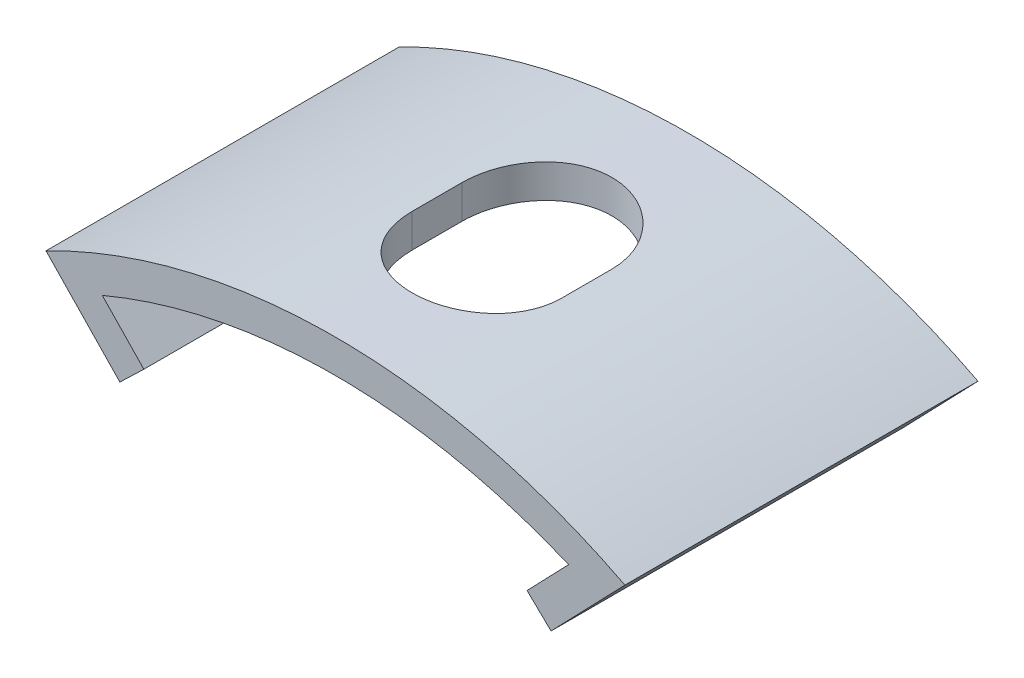
ISO-10303-21;
HEADER;
FILE_DESCRIPTION(('STEP AP214'),'2;1');
FILE_NAME('part.step','',(''),(''),'','','');
FILE_SCHEMA(('AUTOMOTIVE_DESIGN { 1 0 10303 214 1 1 1 1 }'));
ENDSEC;
DATA;
#1=APPLICATION_CONTEXT('core data for automotive mechanical design processes');
#2=APPLICATION_PROTOCOL_DEFINITION('international standard','automotive_design',2000,#1);
#3=PRODUCT_CONTEXT('',#1,'mechanical');
#4=PRODUCT('Part','Part','',(#3));
#5=PRODUCT_RELATED_PRODUCT_CATEGORY('part','',(#4));
#6=PRODUCT_DEFINITION_FORMATION('','',#4);
#7=PRODUCT_DEFINITION_CONTEXT('part definition',#1,'design');
#8=PRODUCT_DEFINITION('design','',#6,#7);
#9=PRODUCT_DEFINITION_SHAPE('','',#8);
#10=(LENGTH_UNIT() NAMED_UNIT(*) SI_UNIT(.MILLI.,.METRE.));
#11=(NAMED_UNIT(*) PLANE_ANGLE_UNIT() SI_UNIT($,.RADIAN.));
#12=(NAMED_UNIT(*) SI_UNIT($,.STERADIAN.) SOLID_ANGLE_UNIT());
#13=UNCERTAINTY_MEASURE_WITH_UNIT(LENGTH_MEASURE(1.E-05),#10,'distance_accuracy_value','');
#14=(GEOMETRIC_REPRESENTATION_CONTEXT(3) GLOBAL_UNCERTAINTY_ASSIGNED_CONTEXT((#13)) GLOBAL_UNIT_ASSIGNED_CONTEXT((#10,
#11,#12)) REPRESENTATION_CONTEXT('',''));
#15=CARTESIAN_POINT('',(0.,0.,0.));
#16=DIRECTION('',(0.,0.,1.));
#17=DIRECTION('',(1.,0.,0.));
#18=AXIS2_PLACEMENT_3D('',#15,#16,#17);
#19=CARTESIAN_POINT('',(0.,0.,5.3));
#20=DIRECTION('',(0.,0.,-1.));
#21=DIRECTION('',(-1.,0.,0.));
#22=AXIS2_PLACEMENT_3D('',#19,#20,#21);
#23=CYLINDRICAL_SURFACE('',#22,18.);
#24=CARTESIAN_POINT('',(0.,0.,-5.3));
#25=DIRECTION('',(0.,0.,1.));
#26=DIRECTION('',(1.,0.,0.));
#27=AXIS2_PLACEMENT_3D('',#24,#25,#26);
#28=CIRCLE('',#27,18.);
#29=CARTESIAN_POINT('',(7.,16.583123951777,-5.3));
#30=VERTEX_POINT('',#29);
#31=CARTESIAN_POINT('',(-7.,16.583123951777,-5.3));
#32=VERTEX_POINT('',#31);
#33=EDGE_CURVE('E225',#30,#32,#28,.T.);
#34=ORIENTED_EDGE('',*,*,#33,.F.);
#35=DIRECTION('',(0.,0.,-1.));
#36=VECTOR('',#35,1.);
#37=CARTESIAN_POINT('',(7.,16.583123951777,5.3));
#38=LINE('',#37,#36);
#39=CARTESIAN_POINT('',(7.,16.583123951777,5.3));
#40=VERTEX_POINT('',#39);
#41=EDGE_CURVE('E246',#40,#30,#38,.T.);
#42=ORIENTED_EDGE('',*,*,#41,.F.);
#43=CARTESIAN_POINT('',(0.,0.,5.3));
#44=DIRECTION('',(0.,0.,1.));
#45=DIRECTION('',(1.,0.,0.));
#46=AXIS2_PLACEMENT_3D('',#43,#44,#45);
#47=CIRCLE('',#46,18.);
#48=CARTESIAN_POINT('',(-7.,16.583123951777,5.3));
#49=VERTEX_POINT('',#48);
#50=EDGE_CURVE('E260',#40,#49,#47,.T.);
#51=ORIENTED_EDGE('',*,*,#50,.T.);
#52=DIRECTION('',(0.,0.,-1.));
#53=VECTOR('',#52,1.);
#54=CARTESIAN_POINT('',(-7.,16.583123951777,5.3));
#55=LINE('',#54,#53);
#56=EDGE_CURVE('E248',#49,#32,#55,.T.);
#57=ORIENTED_EDGE('',*,*,#56,.T.);
#58=EDGE_LOOP('',(#34,#42,#51,#57));
#59=FACE_BOUND('',#58,.T.);
#60=DIRECTION('',(0.,0.,-1.));
#61=VECTOR('',#60,1.);
#62=CARTESIAN_POINT('',(-2.25,17.858821349686,5.3));
#63=LINE('',#62,#61);
#64=CARTESIAN_POINT('',(-2.25,17.858821349686,-0.75));
#65=VERTEX_POINT('',#64);
#66=CARTESIAN_POINT('',(-2.25,17.858821349686,0.75));
#67=VERTEX_POINT('',#66);
#68=EDGE_CURVE('E173',#65,#67,#63,.F.);
#69=ORIENTED_EDGE('',*,*,#68,.T.);
#70=CARTESIAN_POINT('',(-2.25,17.858821349686,0.75));
#71=CARTESIAN_POINT('',(-2.24999987433453,17.8588194251762,0.813038421910983));
#72=CARTESIAN_POINT('',(-2.24734910280741,17.8591555464734,0.876046400447922));
#73=CARTESIAN_POINT('',(-2.2367760280738,17.860483614898,1.00160662816571));
#74=CARTESIAN_POINT('',(-2.22885413082701,17.8614755115204,1.06415891206719));
#75=CARTESIAN_POINT('',(-2.19726613729562,17.8653995354746,1.25031674039511));
#76=CARTESIAN_POINT('',(-2.16577747401027,17.8692801491553,1.37266760263013));
#77=CARTESIAN_POINT('',(-2.08284998220627,17.8791347069465,1.61029050708662));
#78=CARTESIAN_POINT('',(-2.03140462668968,17.8851093358599,1.72556021905842));
#79=CARTESIAN_POINT('',(-1.9100445468626,17.8984759849888,1.94583988541639));
#80=CARTESIAN_POINT('',(-1.8401312637343,17.9058678945916,2.0508506395056));
#81=CARTESIAN_POINT('',(-1.68341206734406,17.9212816202412,2.24819255503716));
#82=CARTESIAN_POINT('',(-1.59652505875848,17.9293063453518,2.34045906512173));
#83=CARTESIAN_POINT('',(-1.4084881592424,17.9450563047993,2.50915218989586));
#84=CARTESIAN_POINT('',(-1.30733609827826,17.9527814933416,2.58557639023872));
#85=CARTESIAN_POINT('',(-1.09323565451996,17.9670912133723,2.72063635035758));
#86=CARTESIAN_POINT('',(-0.980249611183446,17.9736719143119,2.77921284845707));
#87=CARTESIAN_POINT('',(-0.745954846626403,17.9849184109182,2.87653235189302));
#88=CARTESIAN_POINT('',(-0.624646927843693,17.98958439091,2.9152772664524));
#89=CARTESIAN_POINT('',(-0.377817617303712,17.9964554763961,2.97164252706326));
#90=CARTESIAN_POINT('',(-0.252321524361256,17.9986733000917,2.98937208399253));
#91=CARTESIAN_POINT('',(-0.000113958053788392,18.0004416380206,3.00354192890028));
#92=CARTESIAN_POINT('',(0.126597496892533,17.9999921926125,2.9999825390033));
#93=CARTESIAN_POINT('',(0.376889084753837,17.996486825208,2.97176228226685));
#94=CARTESIAN_POINT('',(0.500482760825345,17.9934454852649,2.94721946613686));
#95=CARTESIAN_POINT('',(0.741782589261214,17.9851144748259,2.87791368788275));
#96=CARTESIAN_POINT('',(0.859488661703709,17.9798247738188,2.83315045135721));
#97=CARTESIAN_POINT('',(1.08604033017171,17.9675661901284,2.72454804183679));
#98=CARTESIAN_POINT('',(1.19486100591024,17.9605927880744,2.66065741466114));
#99=CARTESIAN_POINT('',(1.40027581309508,17.9457473888532,2.51565390113486));
#100=CARTESIAN_POINT('',(1.49686990014344,17.9378753884233,2.43454095224834));
#101=CARTESIAN_POINT('',(1.67577600776006,17.9220509715218,2.25674697940169));
#102=CARTESIAN_POINT('',(1.75798787566357,17.9140983698413,2.15996517270914));
#103=CARTESIAN_POINT('',(1.90504051240019,17.8990587520914,1.95388697055325));
#104=CARTESIAN_POINT('',(1.96987611791605,17.8919719936451,1.84458686904738));
#105=CARTESIAN_POINT('',(2.08034030367041,17.8794655923308,1.61647074802186));
#106=CARTESIAN_POINT('',(2.12594942241975,17.8740476401532,1.49764523072224));
#107=CARTESIAN_POINT('',(2.19647134414845,17.8655197697751,1.25402518960859));
#108=CARTESIAN_POINT('',(2.22141531410094,17.8624063766198,1.12923995593975));
#109=CARTESIAN_POINT('',(2.24045955676342,17.860021010604,0.961297341119165));
#110=CARTESIAN_POINT('',(2.24403891993201,17.8595714574598,0.919080958189035));
#111=CARTESIAN_POINT('',(2.24880594188023,17.8589719767877,0.834582343684646));
#112=CARTESIAN_POINT('',(2.2499976086946,17.8588215471485,0.792300341894064));
#113=CARTESIAN_POINT('',(2.25,17.858821349686,0.75));
#114=B_SPLINE_CURVE_WITH_KNOTS('',3,(#70,#71,#72,#73,#74,#75,#76,#77,#78,#79,#80,#81,#82,#83,
#84,#85,#86,#87,#88,#89,#90,#91,#92,#93,#94,#95,#96,#97,#98,#99,#100,#101,#102,#103,#104,#105,
#106,#107,#108,#109,#110,#111,#112,#113),.UNSPECIFIED.,.F.,.F.,(4,2,2,2,2,2,2,2,2,2,2,2,2,2,2,2,
2,2,2,2,2,4),(0.,0.188998328147948,0.377982102132345,0.755226013918386,1.13259341054784,
1.50993136724195,1.88911828117894,2.2683629402761,2.6488534582724,3.02930733885574,
3.40777531688837,3.78623756831039,4.16258453387273,4.53893660680898,4.91631033520017,
5.29368543389454,5.6735920154572,6.05361136055525,6.43401445159375,6.81384277259916,
6.94090357256708,7.06775090645285),.UNSPECIFIED.);
#115=CARTESIAN_POINT('',(2.25,17.858821349686,0.75));
#116=VERTEX_POINT('',#115);
#117=EDGE_CURVE('E138',#67,#116,#114,.T.);
#118=ORIENTED_EDGE('',*,*,#117,.T.);
#119=DIRECTION('',(0.,0.,-1.));
#120=VECTOR('',#119,1.);
#121=CARTESIAN_POINT('',(2.25,17.858821349686,5.3));
#122=LINE('',#121,#120);
#123=CARTESIAN_POINT('',(2.25,17.858821349686,-0.75));
#124=VERTEX_POINT('',#123);
#125=EDGE_CURVE('E172',#116,#124,#122,.T.);
#126=ORIENTED_EDGE('',*,*,#125,.T.);
#127=CARTESIAN_POINT('',(2.25,17.858821349686,-0.75));
#128=CARTESIAN_POINT('',(2.24999987433453,17.8588194251762,-0.813038421910983));
#129=CARTESIAN_POINT('',(2.24734910280741,17.8591555464734,-0.876046400447922));
#130=CARTESIAN_POINT('',(2.2367760280738,17.860483614898,-1.00160662816571));
#131=CARTESIAN_POINT('',(2.22885413082701,17.8614755115204,-1.06415891206719));
#132=CARTESIAN_POINT('',(2.19726613729562,17.8653995354746,-1.25031674039511));
#133=CARTESIAN_POINT('',(2.16577747401027,17.8692801491553,-1.37266760263013));
#134=CARTESIAN_POINT('',(2.08284998220627,17.8791347069465,-1.61029050708662));
#135=CARTESIAN_POINT('',(2.03140462668968,17.8851093358599,-1.72556021905842));
#136=CARTESIAN_POINT('',(1.91004454686259,17.8984759849888,-1.94583988541639));
#137=CARTESIAN_POINT('',(1.8401312637343,17.9058678945916,-2.0508506395056));
#138=CARTESIAN_POINT('',(1.68341206734406,17.9212816202412,-2.24819255503716));
#139=CARTESIAN_POINT('',(1.59652505875848,17.9293063453518,-2.34045906512173));
#140=CARTESIAN_POINT('',(1.4084881592424,17.9450563047993,-2.50915218989586));
#141=CARTESIAN_POINT('',(1.30733609827826,17.9527814933416,-2.58557639023872));
#142=CARTESIAN_POINT('',(1.09323565451996,17.9670912133723,-2.72063635035758));
#143=CARTESIAN_POINT('',(0.980249611183446,17.9736719143119,-2.77921284845707));
#144=CARTESIAN_POINT('',(0.745954846626401,17.9849184109182,-2.87653235189302));
#145=CARTESIAN_POINT('',(0.624646927843692,17.98958439091,-2.9152772664524));
#146=CARTESIAN_POINT('',(0.377817617303711,17.9964554763961,-2.97164252706327));
#147=CARTESIAN_POINT('',(0.252321524361255,17.9986733000917,-2.98937208399253));
#148=CARTESIAN_POINT('',(0.000113958053786956,18.0004416380206,-3.00354192890028));
#149=CARTESIAN_POINT('',(-0.126597496892535,17.9999921926125,-2.9999825390033));
#150=CARTESIAN_POINT('',(-0.376889084753838,17.996486825208,-2.97176228226685));
#151=CARTESIAN_POINT('',(-0.500482760825348,17.9934454852649,-2.94721946613686));
#152=CARTESIAN_POINT('',(-0.741782589261217,17.9851144748259,-2.87791368788275));
#153=CARTESIAN_POINT('',(-0.859488661703711,17.9798247738188,-2.83315045135721));
#154=CARTESIAN_POINT('',(-1.08604033017171,17.9675661901284,-2.72454804183679));
#155=CARTESIAN_POINT('',(-1.19486100591024,17.9605927880744,-2.66065741466114));
#156=CARTESIAN_POINT('',(-1.40027581309508,17.9457473888532,-2.51565390113486));
#157=CARTESIAN_POINT('',(-1.49686990014345,17.9378753884233,-2.43454095224834));
#158=CARTESIAN_POINT('',(-1.67577600776006,17.9220509715218,-2.25674697940169));
#159=CARTESIAN_POINT('',(-1.75798787566357,17.9140983698413,-2.15996517270914));
#160=CARTESIAN_POINT('',(-1.90504051240019,17.8990587520914,-1.95388697055325));
#161=CARTESIAN_POINT('',(-1.96987611791605,17.8919719936451,-1.84458686904739));
#162=CARTESIAN_POINT('',(-2.08034030367041,17.8794655923308,-1.61647074802187));
#163=CARTESIAN_POINT('',(-2.12594942241975,17.8740476401532,-1.49764523072224));
#164=CARTESIAN_POINT('',(-2.19647134414845,17.8655197697751,-1.25402518960859));
#165=CARTESIAN_POINT('',(-2.22141531410094,17.8624063766198,-1.12923995593975));
#166=CARTESIAN_POINT('',(-2.24045955676343,17.860021010604,-0.961297341119165));
#167=CARTESIAN_POINT('',(-2.24403891993201,17.8595714574598,-0.919080958189035));
#168=CARTESIAN_POINT('',(-2.24880594188023,17.8589719767877,-0.834582343684645));
#169=CARTESIAN_POINT('',(-2.24999760869461,17.8588215471485,-0.792300341894064));
#170=CARTESIAN_POINT('',(-2.25,17.858821349686,-0.749999999999999));
#171=B_SPLINE_CURVE_WITH_KNOTS('',3,(#127,#128,#129,#130,#131,#132,#133,#134,#135,#136,#137,
#138,#139,#140,#141,#142,#143,#144,#145,#146,#147,#148,#149,#150,#151,#152,#153,#154,#155,#156,
#157,#158,#159,#160,#161,#162,#163,#164,#165,#166,#167,#168,#169,#170),.UNSPECIFIED.,.F.,.F.,(4,
2,2,2,2,2,2,2,2,2,2,2,2,2,2,2,2,2,2,2,2,4),(0.,0.188998328147948,0.377982102132345,
0.755226013918386,1.13259341054784,1.50993136724195,1.88911828117894,2.2683629402761,
2.6488534582724,3.02930733885574,3.40777531688837,3.78623756831039,4.16258453387273,
4.53893660680899,4.91631033520017,5.29368543389454,5.6735920154572,6.05361136055525,
6.43401445159375,6.81384277259917,6.94090357256708,7.06775090645286),.UNSPECIFIED.);
#172=EDGE_CURVE('E164',#124,#65,#171,.T.);
#173=ORIENTED_EDGE('',*,*,#172,.T.);
#174=EDGE_LOOP('',(#69,#118,#126,#173));
#175=FACE_BOUND('',#174,.T.);
#176=ADVANCED_FACE('F35',(#59,#175),#23,.F.);
#177=CARTESIAN_POINT('',(0.,0.,5.3));
#178=DIRECTION('',(0.,0.,-1.));
#179=DIRECTION('',(-1.,0.,0.));
#180=AXIS2_PLACEMENT_3D('',#177,#178,#179);
#181=CYLINDRICAL_SURFACE('',#180,19.);
#182=CARTESIAN_POINT('',(0.,0.,-5.3));
#183=DIRECTION('',(0.,0.,1.));
#184=DIRECTION('',(1.,0.,0.));
#185=AXIS2_PLACEMENT_3D('',#182,#183,#184);
#186=CIRCLE('',#185,19.);
#187=CARTESIAN_POINT('',(8.68969024076547,16.896428129032,-5.3));
#188=VERTEX_POINT('',#187);
#189=CARTESIAN_POINT('',(-8.68969024076547,16.896428129032,-5.3));
#190=VERTEX_POINT('',#189);
#191=EDGE_CURVE('E210',#188,#190,#186,.T.);
#192=ORIENTED_EDGE('',*,*,#191,.T.);
#193=DIRECTION('',(0.,0.,-1.));
#194=VECTOR('',#193,1.);
#195=CARTESIAN_POINT('',(-8.68969024076547,16.896428129032,5.3));
#196=LINE('',#195,#194);
#197=CARTESIAN_POINT('',(-8.68969024076547,16.896428129032,5.3));
#198=VERTEX_POINT('',#197);
#199=EDGE_CURVE('E237',#198,#190,#196,.T.);
#200=ORIENTED_EDGE('',*,*,#199,.F.);
#201=CARTESIAN_POINT('',(0.,0.,5.3));
#202=DIRECTION('',(0.,0.,1.));
#203=DIRECTION('',(1.,0.,0.));
#204=AXIS2_PLACEMENT_3D('',#201,#202,#203);
#205=CIRCLE('',#204,19.);
#206=CARTESIAN_POINT('',(8.68969024076547,16.896428129032,5.3));
#207=VERTEX_POINT('',#206);
#208=EDGE_CURVE('E221',#207,#198,#205,.T.);
#209=ORIENTED_EDGE('',*,*,#208,.F.);
#210=DIRECTION('',(0.,0.,-1.));
#211=VECTOR('',#210,1.);
#212=CARTESIAN_POINT('',(8.68969024076547,16.896428129032,5.3));
#213=LINE('',#212,#211);
#214=EDGE_CURVE('E239',#207,#188,#213,.T.);
#215=ORIENTED_EDGE('',*,*,#214,.T.);
#216=EDGE_LOOP('',(#192,#200,#209,#215));
#217=FACE_BOUND('',#216,.T.);
#218=CARTESIAN_POINT('',(-2.25,18.8663059447259,0.75));
#219=CARTESIAN_POINT('',(-2.24999984413377,18.866304126766,0.813065444008957));
#220=CARTESIAN_POINT('',(-2.24734683038286,18.8666225662772,0.876100456864434));
#221=CARTESIAN_POINT('',(-2.23676461239271,18.8678808036718,1.00171506453087));
#222=CARTESIAN_POINT('',(-2.22883579857183,18.8688205555769,1.06429469269468));
#223=CARTESIAN_POINT('',(-2.19721906511498,18.8725384514377,1.25053881791379));
#224=CARTESIAN_POINT('',(-2.16570059497972,18.876215376971,1.37294884829296));
#225=CARTESIAN_POINT('',(-2.08268940200505,18.8855534165936,1.61068939978139));
#226=CARTESIAN_POINT('',(-2.0311898629049,18.8912152077282,1.72601748941873));
#227=CARTESIAN_POINT('',(-1.9096974928355,18.9038824486064,1.94640209506089));
#228=CARTESIAN_POINT('',(-1.83970632808281,18.9108877772729,2.05145953535055));
#229=CARTESIAN_POINT('',(-1.68285058840054,18.9254914459535,2.2488249331985));
#230=CARTESIAN_POINT('',(-1.59591314397453,18.9330922589904,2.34107477466332));
#231=CARTESIAN_POINT('',(-1.40777799267168,18.9480090918228,2.50972207917964));
#232=CARTESIAN_POINT('',(-1.3065781169975,18.9553250680887,2.5861171269167));
#233=CARTESIAN_POINT('',(-1.09242950974802,18.9688725160587,2.72108165180554));
#234=CARTESIAN_POINT('',(-0.979447124621018,18.975100737433,2.77959808332987));
#235=CARTESIAN_POINT('',(-0.745179993513777,18.985743053388,2.87680195802174));
#236=CARTESIAN_POINT('',(-0.623896020192753,18.9901573165335,2.91549124373732));
#237=CARTESIAN_POINT('',(-0.377065646956689,18.9966571872975,2.97177169513252));
#238=CARTESIAN_POINT('',(-0.251541895868488,18.9987536150932,2.98946092262533));
#239=CARTESIAN_POINT('',(0.000711970235301823,19.0004185383706,3.00354301109507));
#240=CARTESIAN_POINT('',(0.127442071650238,18.9999870623187,2.99993611188586));
#241=CARTESIAN_POINT('',(0.377837656700778,18.9966534829824,2.9716064392706));
#242=CARTESIAN_POINT('',(0.501515328123363,18.9937637890536,2.94698972369523));
#243=CARTESIAN_POINT('',(0.742970891810421,18.9858525077212,2.87750493446024));
#244=CARTESIAN_POINT('',(0.860748713087663,18.9808308946732,2.83263661719752));
#245=CARTESIAN_POINT('',(1.08739417162659,18.9691986105771,2.72380756445231));
#246=CARTESIAN_POINT('',(1.19623924436736,18.9625840719268,2.65980026694911));
#247=CARTESIAN_POINT('',(1.4016780442815,18.9485069935124,2.51454671739229));
#248=CARTESIAN_POINT('',(1.49827179267252,18.9410444552171,2.43330049519482));
#249=CARTESIAN_POINT('',(1.67708146493049,18.9260538253829,2.25529359456109));
#250=CARTESIAN_POINT('',(1.75920752476244,18.9185256093612,2.15844264223406));
#251=CARTESIAN_POINT('',(1.90607611238423,18.9042941674795,1.95224612854428));
#252=CARTESIAN_POINT('',(1.97081344036131,18.8975911887167,1.84289684366567));
#253=CARTESIAN_POINT('',(2.08106902250753,18.8857682243098,1.61471612700434));
#254=CARTESIAN_POINT('',(2.12656907316942,18.8806497392327,1.49587584007561));
#255=CARTESIAN_POINT('',(2.19687527764837,18.872599510043,1.25225438931704));
#256=CARTESIAN_POINT('',(2.22171263247485,18.8696644696046,1.12748248463915));
#257=CARTESIAN_POINT('',(2.2405901012447,18.8674260294376,0.959849720419371));
#258=CARTESIAN_POINT('',(2.24412051000476,18.8670062867246,0.917921350010672));
#259=CARTESIAN_POINT('',(2.24882229454311,18.8664465763562,0.834001213167836));
#260=CARTESIAN_POINT('',(2.24999761940603,18.8663061403527,0.792009671218649));
#261=CARTESIAN_POINT('',(2.25,18.8663059447259,0.75));
#262=B_SPLINE_CURVE_WITH_KNOTS('',3,(#218,#219,#220,#221,#222,#223,#224,#225,#226,#227,#228,
#229,#230,#231,#232,#233,#234,#235,#236,#237,#238,#239,#240,#241,#242,#243,#244,#245,#246,#247,
#248,#249,#250,#251,#252,#253,#254,#255,#256,#257,#258,#259,#260,#261),.UNSPECIFIED.,.F.,.F.,(4,
2,2,2,2,2,2,2,2,2,2,2,2,2,2,2,2,2,2,2,2,4),(0.,0.189079425503063,0.378144860356892,
0.755564078222733,1.13311216071341,1.510626235245,1.88980094259794,2.26903337097799,
2.64938028868305,3.02969185411809,3.40822044347497,3.7867447702622,4.16336952684837,
4.53999881391062,4.91755193870435,5.29510440961777,5.67492510427658,6.05485925190686,
6.4351521165356,6.81486968499599,6.94105757499129,7.06703369118151),.UNSPECIFIED.);
#263=CARTESIAN_POINT('',(-2.25,18.8663059447259,0.75));
#264=VERTEX_POINT('',#263);
#265=CARTESIAN_POINT('',(2.25,18.8663059447259,0.75));
#266=VERTEX_POINT('',#265);
#267=EDGE_CURVE('E11',#264,#266,#262,.T.);
#268=ORIENTED_EDGE('',*,*,#267,.F.);
#269=DIRECTION('',(0.,0.,-1.));
#270=VECTOR('',#269,1.);
#271=CARTESIAN_POINT('',(-2.25,18.8663059447259,5.3));
#272=LINE('',#271,#270);
#273=CARTESIAN_POINT('',(-2.25,18.8663059447259,-0.750000000000001));
#274=VERTEX_POINT('',#273);
#275=EDGE_CURVE('E125',#274,#264,#272,.F.);
#276=ORIENTED_EDGE('',*,*,#275,.F.);
#277=CARTESIAN_POINT('',(2.25,18.8663059447259,-0.75));
#278=CARTESIAN_POINT('',(2.24999984413377,18.866304126766,-0.813065444008957));
#279=CARTESIAN_POINT('',(2.24734683038285,18.8666225662772,-0.876100456864433));
#280=CARTESIAN_POINT('',(2.23676461239271,18.8678808036718,-1.00171506453087));
#281=CARTESIAN_POINT('',(2.22883579857183,18.8688205555769,-1.06429469269468));
#282=CARTESIAN_POINT('',(2.19721906511497,18.8725384514377,-1.25053881791379));
#283=CARTESIAN_POINT('',(2.16570059497971,18.876215376971,-1.37294884829296));
#284=CARTESIAN_POINT('',(2.08268940200505,18.8855534165936,-1.61068939978139));
#285=CARTESIAN_POINT('',(2.0311898629049,18.8912152077282,-1.72601748941873));
#286=CARTESIAN_POINT('',(1.9096974928355,18.9038824486064,-1.94640209506089));
#287=CARTESIAN_POINT('',(1.8397063280828,18.9108877772729,-2.05145953535055));
#288=CARTESIAN_POINT('',(1.68285058840054,18.9254914459535,-2.2488249331985));
#289=CARTESIAN_POINT('',(1.59591314397453,18.9330922589904,-2.34107477466332));
#290=CARTESIAN_POINT('',(1.40777799267168,18.9480090918228,-2.50972207917964));
#291=CARTESIAN_POINT('',(1.30657811699749,18.9553250680887,-2.5861171269167));
#292=CARTESIAN_POINT('',(1.09242950974802,18.9688725160587,-2.72108165180554));
#293=CARTESIAN_POINT('',(0.979447124621017,18.975100737433,-2.77959808332987));
#294=CARTESIAN_POINT('',(0.745179993513776,18.985743053388,-2.87680195802174));
#295=CARTESIAN_POINT('',(0.623896020192752,18.9901573165335,-2.91549124373732));
#296=CARTESIAN_POINT('',(0.377065646956688,18.9966571872975,-2.97177169513252));
#297=CARTESIAN_POINT('',(0.251541895868486,18.9987536150932,-2.98946092262533));
#298=CARTESIAN_POINT('',(-0.000711970235303124,19.0004185383706,-3.00354301109507));
#299=CARTESIAN_POINT('',(-0.127442071650239,18.9999870623187,-2.99993611188586));
#300=CARTESIAN_POINT('',(-0.377837656700779,18.9966534829824,-2.9716064392706));
#301=CARTESIAN_POINT('',(-0.501515328123365,18.9937637890536,-2.94698972369523));
#302=CARTESIAN_POINT('',(-0.742970891810423,18.9858525077212,-2.87750493446024));
#303=CARTESIAN_POINT('',(-0.860748713087664,18.9808308946732,-2.83263661719752));
#304=CARTESIAN_POINT('',(-1.08739417162659,18.9691986105771,-2.72380756445231));
#305=CARTESIAN_POINT('',(-1.19623924436736,18.9625840719268,-2.65980026694912));
#306=CARTESIAN_POINT('',(-1.4016780442815,18.9485069935124,-2.51454671739229));
#307=CARTESIAN_POINT('',(-1.49827179267252,18.9410444552171,-2.43330049519482));
#308=CARTESIAN_POINT('',(-1.67708146493049,18.9260538253829,-2.25529359456109));
#309=CARTESIAN_POINT('',(-1.75920752476244,18.9185256093612,-2.15844264223406));
#310=CARTESIAN_POINT('',(-1.90607611238423,18.9042941674794,-1.95224612854428));
#311=CARTESIAN_POINT('',(-1.97081344036131,18.8975911887167,-1.84289684366567));
#312=CARTESIAN_POINT('',(-2.08106902250753,18.8857682243098,-1.61471612700434));
#313=CARTESIAN_POINT('',(-2.12656907316942,18.8806497392328,-1.49587584007561));
#314=CARTESIAN_POINT('',(-2.19687527764837,18.872599510043,-1.25225438931704));
#315=CARTESIAN_POINT('',(-2.22171263247485,18.8696644696046,-1.12748248463915));
#316=CARTESIAN_POINT('',(-2.24059010124471,18.8674260294376,-0.959849720419372));
#317=CARTESIAN_POINT('',(-2.24412051000476,18.8670062867246,-0.917921350010673));
#318=CARTESIAN_POINT('',(-2.24882229454311,18.8664465763562,-0.834001213167836));
#319=CARTESIAN_POINT('',(-2.24999761940603,18.8663061403527,-0.792009671218648));
#320=CARTESIAN_POINT('',(-2.25,18.8663059447259,-0.749999999999999));
#321=B_SPLINE_CURVE_WITH_KNOTS('',3,(#277,#278,#279,#280,#281,#282,#283,#284,#285,#286,#287,
#288,#289,#290,#291,#292,#293,#294,#295,#296,#297,#298,#299,#300,#301,#302,#303,#304,#305,#306,
#307,#308,#309,#310,#311,#312,#313,#314,#315,#316,#317,#318,#319,#320),.UNSPECIFIED.,.F.,.F.,(4,
2,2,2,2,2,2,2,2,2,2,2,2,2,2,2,2,2,2,2,2,4),(0.,0.189079425503062,0.378144860356892,
0.755564078222733,1.13311216071341,1.510626235245,1.88980094259794,2.26903337097799,
2.64938028868305,3.02969185411809,3.40822044347497,3.7867447702622,4.16336952684837,
4.53999881391062,4.91755193870435,5.29510440961777,5.67492510427658,6.05485925190686,
6.4351521165356,6.814869684996,6.9410575749913,7.06703369118151),.UNSPECIFIED.);
#322=CARTESIAN_POINT('',(2.25,18.8663059447259,-0.75));
#323=VERTEX_POINT('',#322);
#324=EDGE_CURVE('E130',#323,#274,#321,.T.);
#325=ORIENTED_EDGE('',*,*,#324,.F.);
#326=DIRECTION('',(0.,0.,-1.));
#327=VECTOR('',#326,1.);
#328=CARTESIAN_POINT('',(2.25,18.8663059447259,5.3));
#329=LINE('',#328,#327);
#330=EDGE_CURVE('E48',#266,#323,#329,.T.);
#331=ORIENTED_EDGE('',*,*,#330,.F.);
#332=EDGE_LOOP('',(#268,#276,#325,#331));
#333=FACE_BOUND('',#332,.T.);
#334=ADVANCED_FACE('F142',(#217,#333),#181,.T.);
#335=CARTESIAN_POINT('',(-7.72042085561147,15.889586792859,5.3));
#336=DIRECTION('',(0.720420855611469,0.693537158917991,0.));
#337=DIRECTION('',(-0.693537158917991,0.720420855611469,0.));
#338=AXIS2_PLACEMENT_3D('',#335,#336,#337);
#339=PLANE('',#338);
#340=DIRECTION('',(0.693537158917991,-0.720420855611469,0.));
#341=VECTOR('',#340,1.);
#342=CARTESIAN_POINT('',(-7.72042085561147,15.889586792859,-5.3));
#343=LINE('',#342,#341);
#344=CARTESIAN_POINT('',(-6.47205396955908,14.5928292527584,-5.3));
#345=VERTEX_POINT('',#344);
#346=EDGE_CURVE('E189',#190,#345,#343,.T.);
#347=ORIENTED_EDGE('',*,*,#346,.T.);
#348=DIRECTION('',(0.,0.,-1.));
#349=VECTOR('',#348,1.);
#350=CARTESIAN_POINT('',(-6.47205396955908,14.5928292527584,5.3));
#351=LINE('',#350,#349);
#352=CARTESIAN_POINT('',(-6.47205396955908,14.5928292527584,5.3));
#353=VERTEX_POINT('',#352);
#354=EDGE_CURVE('E131',#353,#345,#351,.T.);
#355=ORIENTED_EDGE('',*,*,#354,.F.);
#356=DIRECTION('',(0.693537158917991,-0.720420855611469,0.));
#357=VECTOR('',#356,1.);
#358=CARTESIAN_POINT('',(-7.72042085561147,15.889586792859,5.3));
#359=LINE('',#358,#357);
#360=EDGE_CURVE('E190',#198,#353,#359,.T.);
#361=ORIENTED_EDGE('',*,*,#360,.F.);
#362=ORIENTED_EDGE('',*,*,#199,.T.);
#363=EDGE_LOOP('',(#347,#355,#361,#362));
#364=FACE_BOUND('',#363,.T.);
#365=ADVANCED_FACE('F37',(#364),#339,.F.);
#366=CARTESIAN_POINT('',(-5.75163311394761,15.2863664116764,5.3));
#367=DIRECTION('',(0.693537158917991,-0.720420855611469,0.));
#368=DIRECTION('',(0.720420855611469,0.693537158917991,0.));
#369=AXIS2_PLACEMENT_3D('',#366,#367,#368);
#370=PLANE('',#369);
#371=DIRECTION('',(-0.720420855611469,-0.693537158917991,0.));
#372=VECTOR('',#371,1.);
#373=CARTESIAN_POINT('',(-5.75163311394761,15.2863664116764,-5.3));
#374=LINE('',#373,#372);
#375=CARTESIAN_POINT('',(-5.75163311394761,15.2863664116764,-5.3));
#376=VERTEX_POINT('',#375);
#377=EDGE_CURVE('E213',#376,#345,#374,.T.);
#378=ORIENTED_EDGE('',*,*,#377,.F.);
#379=DIRECTION('',(0.,0.,-1.));
#380=VECTOR('',#379,1.);
#381=CARTESIAN_POINT('',(-5.75163311394761,15.2863664116764,5.3));
#382=LINE('',#381,#380);
#383=CARTESIAN_POINT('',(-5.75163311394761,15.2863664116764,5.3));
#384=VERTEX_POINT('',#383);
#385=EDGE_CURVE('E250',#384,#376,#382,.T.);
#386=ORIENTED_EDGE('',*,*,#385,.F.);
#387=DIRECTION('',(-0.720420855611469,-0.693537158917991,0.));
#388=VECTOR('',#387,1.);
#389=CARTESIAN_POINT('',(-5.75163311394761,15.2863664116764,5.3));
#390=LINE('',#389,#388);
#391=EDGE_CURVE('E255',#384,#353,#390,.T.);
#392=ORIENTED_EDGE('',*,*,#391,.T.);
#393=ORIENTED_EDGE('',*,*,#354,.T.);
#394=EDGE_LOOP('',(#378,#386,#392,#393));
#395=FACE_BOUND('',#394,.T.);
#396=ADVANCED_FACE('F253',(#395),#370,.T.);
#397=CARTESIAN_POINT('',(-7.,16.583123951777,5.3));
#398=DIRECTION('',(0.720420855611469,0.693537158917991,0.));
#399=DIRECTION('',(-0.693537158917991,0.720420855611469,0.));
#400=AXIS2_PLACEMENT_3D('',#397,#398,#399);
#401=PLANE('',#400);
#402=DIRECTION('',(0.693537158917991,-0.720420855611469,0.));
#403=VECTOR('',#402,1.);
#404=CARTESIAN_POINT('',(-7.,16.583123951777,-5.3));
#405=LINE('',#404,#403);
#406=EDGE_CURVE('E218',#32,#376,#405,.T.);
#407=ORIENTED_EDGE('',*,*,#406,.F.);
#408=ORIENTED_EDGE('',*,*,#56,.F.);
#409=DIRECTION('',(0.693537158917991,-0.720420855611469,0.));
#410=VECTOR('',#409,1.);
#411=CARTESIAN_POINT('',(-7.,16.583123951777,5.3));
#412=LINE('',#411,#410);
#413=EDGE_CURVE('E258',#49,#384,#412,.T.);
#414=ORIENTED_EDGE('',*,*,#413,.T.);
#415=ORIENTED_EDGE('',*,*,#385,.T.);
#416=EDGE_LOOP('',(#407,#408,#414,#415));
#417=FACE_BOUND('',#416,.T.);
#418=ADVANCED_FACE('F183',(#417),#401,.T.);
#419=CARTESIAN_POINT('',(7.,16.583123951777,5.3));
#420=DIRECTION('',(-0.720420855611469,0.693537158917991,0.));
#421=DIRECTION('',(-0.693537158917991,-0.720420855611469,0.));
#422=AXIS2_PLACEMENT_3D('',#419,#420,#421);
#423=PLANE('',#422);
#424=DIRECTION('',(0.693537158917991,0.720420855611469,0.));
#425=VECTOR('',#424,1.);
#426=CARTESIAN_POINT('',(7.,16.583123951777,-5.3));
#427=LINE('',#426,#425);
#428=CARTESIAN_POINT('',(5.75163311394762,15.2863664116764,-5.3));
#429=VERTEX_POINT('',#428);
#430=EDGE_CURVE('E228',#429,#30,#427,.T.);
#431=ORIENTED_EDGE('',*,*,#430,.F.);
#432=DIRECTION('',(0.,0.,-1.));
#433=VECTOR('',#432,1.);
#434=CARTESIAN_POINT('',(5.75163311394762,15.2863664116764,5.3));
#435=LINE('',#434,#433);
#436=CARTESIAN_POINT('',(5.75163311394762,15.2863664116764,5.3));
#437=VERTEX_POINT('',#436);
#438=EDGE_CURVE('E244',#437,#429,#435,.T.);
#439=ORIENTED_EDGE('',*,*,#438,.F.);
#440=DIRECTION('',(0.693537158917991,0.720420855611469,0.));
#441=VECTOR('',#440,1.);
#442=CARTESIAN_POINT('',(7.,16.583123951777,5.3));
#443=LINE('',#442,#441);
#444=EDGE_CURVE('E265',#437,#40,#443,.T.);
#445=ORIENTED_EDGE('',*,*,#444,.T.);
#446=ORIENTED_EDGE('',*,*,#41,.T.);
#447=EDGE_LOOP('',(#431,#439,#445,#446));
#448=FACE_BOUND('',#447,.T.);
#449=ADVANCED_FACE('F181',(#448),#423,.T.);
#450=CARTESIAN_POINT('',(6.47205396955909,14.5928292527584,5.3));
#451=DIRECTION('',(-0.693537158917991,-0.720420855611469,0.));
#452=DIRECTION('',(0.720420855611469,-0.693537158917991,0.));
#453=AXIS2_PLACEMENT_3D('',#450,#451,#452);
#454=PLANE('',#453);
#455=DIRECTION('',(-0.720420855611469,0.693537158917991,0.));
#456=VECTOR('',#455,1.);
#457=CARTESIAN_POINT('',(6.47205396955909,14.5928292527584,-5.3));
#458=LINE('',#457,#456);
#459=CARTESIAN_POINT('',(6.47205396955909,14.5928292527584,-5.3));
#460=VERTEX_POINT('',#459);
#461=EDGE_CURVE('E231',#460,#429,#458,.T.);
#462=ORIENTED_EDGE('',*,*,#461,.F.);
#463=DIRECTION('',(0.,0.,-1.));
#464=VECTOR('',#463,1.);
#465=CARTESIAN_POINT('',(6.47205396955909,14.5928292527584,5.3));
#466=LINE('',#465,#464);
#467=CARTESIAN_POINT('',(6.47205396955909,14.5928292527584,5.3));
#468=VERTEX_POINT('',#467);
#469=EDGE_CURVE('E242',#468,#460,#466,.T.);
#470=ORIENTED_EDGE('',*,*,#469,.F.);
#471=DIRECTION('',(-0.720420855611469,0.693537158917991,0.));
#472=VECTOR('',#471,1.);
#473=CARTESIAN_POINT('',(6.47205396955909,14.5928292527584,5.3));
#474=LINE('',#473,#472);
#475=EDGE_CURVE('E268',#468,#437,#474,.T.);
#476=ORIENTED_EDGE('',*,*,#475,.T.);
#477=ORIENTED_EDGE('',*,*,#438,.T.);
#478=EDGE_LOOP('',(#462,#470,#476,#477));
#479=FACE_BOUND('',#478,.T.);
#480=ADVANCED_FACE('F279',(#479),#454,.T.);
#481=CARTESIAN_POINT('',(7.72042085561147,15.889586792859,5.3));
#482=DIRECTION('',(-0.720420855611469,0.693537158917991,0.));
#483=DIRECTION('',(-0.693537158917991,-0.720420855611469,0.));
#484=AXIS2_PLACEMENT_3D('',#481,#482,#483);
#485=PLANE('',#484);
#486=DIRECTION('',(0.693537158917991,0.720420855611469,0.));
#487=VECTOR('',#486,1.);
#488=CARTESIAN_POINT('',(7.72042085561147,15.889586792859,-5.3));
#489=LINE('',#488,#487);
#490=EDGE_CURVE('E234',#460,#188,#489,.T.);
#491=ORIENTED_EDGE('',*,*,#490,.T.);
#492=ORIENTED_EDGE('',*,*,#214,.F.);
#493=DIRECTION('',(0.693537158917991,0.720420855611469,0.));
#494=VECTOR('',#493,1.);
#495=CARTESIAN_POINT('',(7.72042085561147,15.889586792859,5.3));
#496=LINE('',#495,#494);
#497=EDGE_CURVE('E270',#468,#207,#496,.T.);
#498=ORIENTED_EDGE('',*,*,#497,.F.);
#499=ORIENTED_EDGE('',*,*,#469,.T.);
#500=EDGE_LOOP('',(#491,#492,#498,#499));
#501=FACE_BOUND('',#500,.T.);
#502=ADVANCED_FACE('F199',(#501),#485,.F.);
#503=CARTESIAN_POINT('',(0.,0.,5.3));
#504=DIRECTION('',(0.,0.,1.));
#505=DIRECTION('',(1.,0.,0.));
#506=AXIS2_PLACEMENT_3D('',#503,#504,#505);
#507=PLANE('',#506);
#508=ORIENTED_EDGE('',*,*,#360,.T.);
#509=ORIENTED_EDGE('',*,*,#391,.F.);
#510=ORIENTED_EDGE('',*,*,#413,.F.);
#511=ORIENTED_EDGE('',*,*,#50,.F.);
#512=ORIENTED_EDGE('',*,*,#444,.F.);
#513=ORIENTED_EDGE('',*,*,#475,.F.);
#514=ORIENTED_EDGE('',*,*,#497,.T.);
#515=ORIENTED_EDGE('',*,*,#208,.T.);
#516=EDGE_LOOP('',(#508,#509,#510,#511,#512,#513,#514,#515));
#517=FACE_BOUND('',#516,.T.);
#518=ADVANCED_FACE('F196',(#517),#507,.T.);
#519=CARTESIAN_POINT('',(0.,0.,-5.3));
#520=DIRECTION('',(0.,0.,1.));
#521=DIRECTION('',(1.,0.,0.));
#522=AXIS2_PLACEMENT_3D('',#519,#520,#521);
#523=PLANE('',#522);
#524=ORIENTED_EDGE('',*,*,#346,.F.);
#525=ORIENTED_EDGE('',*,*,#191,.F.);
#526=ORIENTED_EDGE('',*,*,#490,.F.);
#527=ORIENTED_EDGE('',*,*,#461,.T.);
#528=ORIENTED_EDGE('',*,*,#430,.T.);
#529=ORIENTED_EDGE('',*,*,#33,.T.);
#530=ORIENTED_EDGE('',*,*,#406,.T.);
#531=ORIENTED_EDGE('',*,*,#377,.T.);
#532=EDGE_LOOP('',(#524,#525,#526,#527,#528,#529,#530,#531));
#533=FACE_BOUND('',#532,.T.);
#534=ADVANCED_FACE('F195',(#533),#523,.F.);
#535=CARTESIAN_POINT('',(0.,23.5,0.75));
#536=DIRECTION('',(0.,-1.,0.));
#537=DIRECTION('',(0.,0.,-1.));
#538=AXIS2_PLACEMENT_3D('',#535,#536,#537);
#539=CYLINDRICAL_SURFACE('',#538,2.25);
#540=DIRECTION('',(0.,-1.,0.));
#541=VECTOR('',#540,1.);
#542=CARTESIAN_POINT('',(-2.25,23.5,0.75));
#543=LINE('',#542,#541);
#544=EDGE_CURVE('E55',#264,#67,#543,.T.);
#545=ORIENTED_EDGE('',*,*,#544,.F.);
#546=ORIENTED_EDGE('',*,*,#267,.T.);
#547=DIRECTION('',(0.,-1.,0.));
#548=VECTOR('',#547,1.);
#549=CARTESIAN_POINT('',(2.25,23.5,0.75));
#550=LINE('',#549,#548);
#551=EDGE_CURVE('E343',#266,#116,#550,.T.);
#552=ORIENTED_EDGE('',*,*,#551,.T.);
#553=ORIENTED_EDGE('',*,*,#117,.F.);
#554=EDGE_LOOP('',(#545,#546,#552,#553));
#555=FACE_BOUND('',#554,.T.);
#556=ADVANCED_FACE('F134',(#555),#539,.F.);
#557=CARTESIAN_POINT('',(2.25,23.5,0.75));
#558=DIRECTION('',(-1.,0.,0.));
#559=DIRECTION('',(0.,0.,1.));
#560=AXIS2_PLACEMENT_3D('',#557,#558,#559);
#561=PLANE('',#560);
#562=ORIENTED_EDGE('',*,*,#551,.F.);
#563=ORIENTED_EDGE('',*,*,#330,.T.);
#564=DIRECTION('',(0.,-1.,0.));
#565=VECTOR('',#564,1.);
#566=CARTESIAN_POINT('',(2.25,23.5,-0.75));
#567=LINE('',#566,#565);
#568=EDGE_CURVE('E345',#323,#124,#567,.T.);
#569=ORIENTED_EDGE('',*,*,#568,.T.);
#570=ORIENTED_EDGE('',*,*,#125,.F.);
#571=EDGE_LOOP('',(#562,#563,#569,#570));
#572=FACE_BOUND('',#571,.T.);
#573=ADVANCED_FACE('F160',(#572),#561,.T.);
#574=CARTESIAN_POINT('',(0.,23.5,-0.75));
#575=DIRECTION('',(0.,-1.,0.));
#576=DIRECTION('',(0.,0.,-1.));
#577=AXIS2_PLACEMENT_3D('',#574,#575,#576);
#578=CYLINDRICAL_SURFACE('',#577,2.25);
#579=ORIENTED_EDGE('',*,*,#568,.F.);
#580=ORIENTED_EDGE('',*,*,#324,.T.);
#581=DIRECTION('',(0.,-1.,0.));
#582=VECTOR('',#581,1.);
#583=CARTESIAN_POINT('',(-2.25,23.5,-0.75));
#584=LINE('',#583,#582);
#585=EDGE_CURVE('E60',#274,#65,#584,.T.);
#586=ORIENTED_EDGE('',*,*,#585,.T.);
#587=ORIENTED_EDGE('',*,*,#172,.F.);
#588=EDGE_LOOP('',(#579,#580,#586,#587));
#589=FACE_BOUND('',#588,.T.);
#590=ADVANCED_FACE('F155',(#589),#578,.F.);
#591=CARTESIAN_POINT('',(-2.25,23.5,0.75));
#592=DIRECTION('',(1.,0.,0.));
#593=DIRECTION('',(0.,0.,-1.));
#594=AXIS2_PLACEMENT_3D('',#591,#592,#593);
#595=PLANE('',#594);
#596=ORIENTED_EDGE('',*,*,#585,.F.);
#597=ORIENTED_EDGE('',*,*,#275,.T.);
#598=ORIENTED_EDGE('',*,*,#544,.T.);
#599=ORIENTED_EDGE('',*,*,#68,.F.);
#600=EDGE_LOOP('',(#596,#597,#598,#599));
#601=FACE_BOUND('',#600,.T.);
#602=ADVANCED_FACE('F126',(#601),#595,.T.);
#603=CLOSED_SHELL('',(#176,#334,#365,#396,#418,#449,#480,#502,#518,#534,#556,#573,#590,#602));
#604=MANIFOLD_SOLID_BREP('B2',#603);
#605=ADVANCED_BREP_SHAPE_REPRESENTATION('',(#18,#604),#14);
#606=SHAPE_DEFINITION_REPRESENTATION(#9,#605);
ENDSEC;
END-ISO-10303-21;
